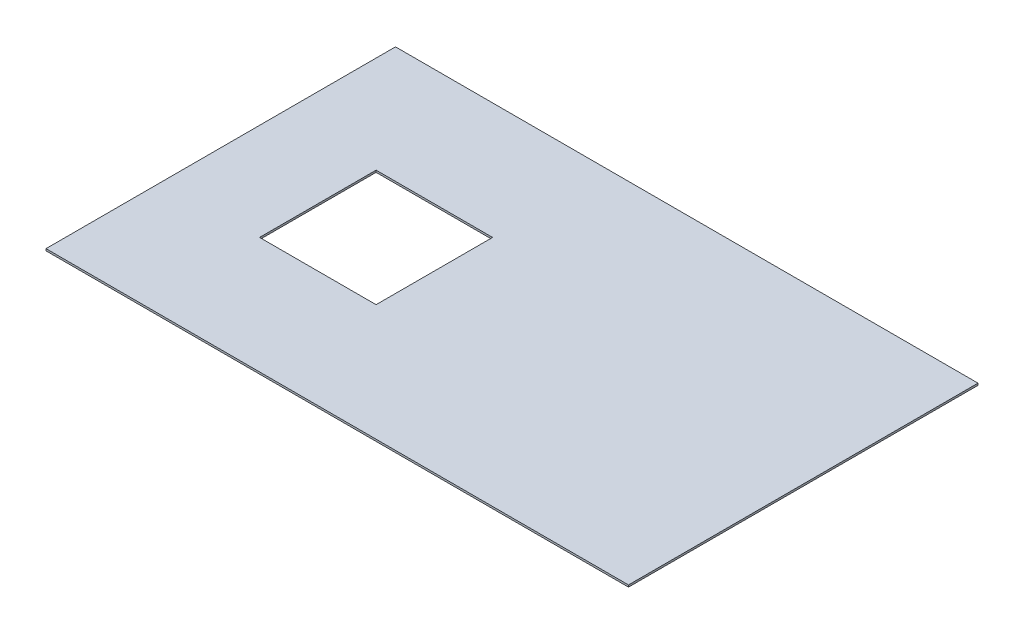
ISO-10303-21;
HEADER;
FILE_DESCRIPTION(('STEP AP214'),'2;1');
FILE_NAME('part.step','',(''),(''),'','','');
FILE_SCHEMA(('AUTOMOTIVE_DESIGN { 1 0 10303 214 1 1 1 1 }'));
ENDSEC;
DATA;
#1=APPLICATION_CONTEXT('core data for automotive mechanical design processes');
#2=APPLICATION_PROTOCOL_DEFINITION('international standard','automotive_design',2000,#1);
#3=PRODUCT_CONTEXT('',#1,'mechanical');
#4=PRODUCT('Part','Part','',(#3));
#5=PRODUCT_RELATED_PRODUCT_CATEGORY('part','',(#4));
#6=PRODUCT_DEFINITION_FORMATION('','',#4);
#7=PRODUCT_DEFINITION_CONTEXT('part definition',#1,'design');
#8=PRODUCT_DEFINITION('design','',#6,#7);
#9=PRODUCT_DEFINITION_SHAPE('','',#8);
#10=(LENGTH_UNIT() NAMED_UNIT(*) SI_UNIT(.MILLI.,.METRE.));
#11=(NAMED_UNIT(*) PLANE_ANGLE_UNIT() SI_UNIT($,.RADIAN.));
#12=(NAMED_UNIT(*) SI_UNIT($,.STERADIAN.) SOLID_ANGLE_UNIT());
#13=UNCERTAINTY_MEASURE_WITH_UNIT(LENGTH_MEASURE(1.E-05),#10,'distance_accuracy_value','');
#14=(GEOMETRIC_REPRESENTATION_CONTEXT(3) GLOBAL_UNCERTAINTY_ASSIGNED_CONTEXT((#13)) GLOBAL_UNIT_ASSIGNED_CONTEXT((#10,
#11,#12)) REPRESENTATION_CONTEXT('',''));
#15=CARTESIAN_POINT('',(0.,0.,0.));
#16=DIRECTION('',(0.,0.,1.));
#17=DIRECTION('',(1.,0.,0.));
#18=AXIS2_PLACEMENT_3D('',#15,#16,#17);
#19=CARTESIAN_POINT('',(0.,10.,0.));
#20=DIRECTION('',(-1.,0.,0.));
#21=DIRECTION('',(0.,0.,1.));
#22=AXIS2_PLACEMENT_3D('',#19,#20,#21);
#23=PLANE('',#22);
#24=DIRECTION('',(0.,0.,-1.));
#25=VECTOR('',#24,1.);
#26=CARTESIAN_POINT('',(0.,0.,0.));
#27=LINE('',#26,#25);
#28=CARTESIAN_POINT('',(0.,0.,0.));
#29=VERTEX_POINT('',#28);
#30=CARTESIAN_POINT('',(0.,0.,-1800.));
#31=VERTEX_POINT('',#30);
#32=EDGE_CURVE('E129',#29,#31,#27,.T.);
#33=ORIENTED_EDGE('',*,*,#32,.T.);
#34=DIRECTION('',(0.,-1.,0.));
#35=VECTOR('',#34,1.);
#36=CARTESIAN_POINT('',(0.,10.,-1800.));
#37=LINE('',#36,#35);
#38=CARTESIAN_POINT('',(0.,10.,-1800.));
#39=VERTEX_POINT('',#38);
#40=EDGE_CURVE('E11',#39,#31,#37,.T.);
#41=ORIENTED_EDGE('',*,*,#40,.F.);
#42=DIRECTION('',(0.,0.,-1.));
#43=VECTOR('',#42,1.);
#44=CARTESIAN_POINT('',(0.,10.,0.));
#45=LINE('',#44,#43);
#46=CARTESIAN_POINT('',(0.,10.,0.));
#47=VERTEX_POINT('',#46);
#48=EDGE_CURVE('E140',#47,#39,#45,.T.);
#49=ORIENTED_EDGE('',*,*,#48,.F.);
#50=DIRECTION('',(0.,-1.,0.));
#51=VECTOR('',#50,1.);
#52=CARTESIAN_POINT('',(0.,10.,0.));
#53=LINE('',#52,#51);
#54=EDGE_CURVE('E149',#47,#29,#53,.T.);
#55=ORIENTED_EDGE('',*,*,#54,.T.);
#56=EDGE_LOOP('',(#33,#41,#49,#55));
#57=FACE_BOUND('',#56,.T.);
#58=ADVANCED_FACE('F31',(#57),#23,.F.);
#59=CARTESIAN_POINT('',(0.,10.,-1800.));
#60=DIRECTION('',(0.,0.,1.));
#61=DIRECTION('',(1.,0.,0.));
#62=AXIS2_PLACEMENT_3D('',#59,#60,#61);
#63=PLANE('',#62);
#64=DIRECTION('',(-1.,0.,0.));
#65=VECTOR('',#64,1.);
#66=CARTESIAN_POINT('',(0.,0.,-1800.));
#67=LINE('',#66,#65);
#68=CARTESIAN_POINT('',(-3000.,0.,-1800.));
#69=VERTEX_POINT('',#68);
#70=EDGE_CURVE('E134',#31,#69,#67,.T.);
#71=ORIENTED_EDGE('',*,*,#70,.T.);
#72=DIRECTION('',(0.,-1.,0.));
#73=VECTOR('',#72,1.);
#74=CARTESIAN_POINT('',(-3000.,10.,-1800.));
#75=LINE('',#74,#73);
#76=CARTESIAN_POINT('',(-3000.,10.,-1800.));
#77=VERTEX_POINT('',#76);
#78=EDGE_CURVE('E38',#77,#69,#75,.T.);
#79=ORIENTED_EDGE('',*,*,#78,.F.);
#80=DIRECTION('',(-1.,0.,0.));
#81=VECTOR('',#80,1.);
#82=CARTESIAN_POINT('',(0.,10.,-1800.));
#83=LINE('',#82,#81);
#84=EDGE_CURVE('E143',#39,#77,#83,.T.);
#85=ORIENTED_EDGE('',*,*,#84,.F.);
#86=ORIENTED_EDGE('',*,*,#40,.T.);
#87=EDGE_LOOP('',(#71,#79,#85,#86));
#88=FACE_BOUND('',#87,.T.);
#89=ADVANCED_FACE('F173',(#88),#63,.F.);
#90=CARTESIAN_POINT('',(-3000.,10.,3.67381906146713E-13));
#91=DIRECTION('',(1.,0.,0.));
#92=DIRECTION('',(0.,0.,-1.));
#93=AXIS2_PLACEMENT_3D('',#90,#91,#92);
#94=PLANE('',#93);
#95=DIRECTION('',(0.,0.,1.));
#96=VECTOR('',#95,1.);
#97=CARTESIAN_POINT('',(-3000.,0.,3.67381906146713E-13));
#98=LINE('',#97,#96);
#99=CARTESIAN_POINT('',(-3000.,0.,3.67381906146713E-13));
#100=VERTEX_POINT('',#99);
#101=EDGE_CURVE('E136',#69,#100,#98,.T.);
#102=ORIENTED_EDGE('',*,*,#101,.T.);
#103=DIRECTION('',(0.,-1.,0.));
#104=VECTOR('',#103,1.);
#105=CARTESIAN_POINT('',(-3000.,10.,3.67381906146713E-13));
#106=LINE('',#105,#104);
#107=CARTESIAN_POINT('',(-3000.,10.,3.67381906146713E-13));
#108=VERTEX_POINT('',#107);
#109=EDGE_CURVE('E152',#108,#100,#106,.T.);
#110=ORIENTED_EDGE('',*,*,#109,.F.);
#111=DIRECTION('',(0.,0.,1.));
#112=VECTOR('',#111,1.);
#113=CARTESIAN_POINT('',(-3000.,10.,3.67381906146713E-13));
#114=LINE('',#113,#112);
#115=EDGE_CURVE('E145',#77,#108,#114,.T.);
#116=ORIENTED_EDGE('',*,*,#115,.F.);
#117=ORIENTED_EDGE('',*,*,#78,.T.);
#118=EDGE_LOOP('',(#102,#110,#116,#117));
#119=FACE_BOUND('',#118,.T.);
#120=ADVANCED_FACE('F159',(#119),#94,.F.);
#121=CARTESIAN_POINT('',(0.,10.,0.));
#122=DIRECTION('',(0.,0.,-1.));
#123=DIRECTION('',(-1.,0.,0.));
#124=AXIS2_PLACEMENT_3D('',#121,#122,#123);
#125=PLANE('',#124);
#126=DIRECTION('',(1.,0.,0.));
#127=VECTOR('',#126,1.);
#128=CARTESIAN_POINT('',(0.,0.,0.));
#129=LINE('',#128,#127);
#130=EDGE_CURVE('E138',#100,#29,#129,.T.);
#131=ORIENTED_EDGE('',*,*,#130,.T.);
#132=ORIENTED_EDGE('',*,*,#54,.F.);
#133=DIRECTION('',(1.,0.,0.));
#134=VECTOR('',#133,1.);
#135=CARTESIAN_POINT('',(0.,10.,0.));
#136=LINE('',#135,#134);
#137=EDGE_CURVE('E147',#108,#47,#136,.T.);
#138=ORIENTED_EDGE('',*,*,#137,.F.);
#139=ORIENTED_EDGE('',*,*,#109,.T.);
#140=EDGE_LOOP('',(#131,#132,#138,#139));
#141=FACE_BOUND('',#140,.T.);
#142=ADVANCED_FACE('F168',(#141),#125,.F.);
#143=CARTESIAN_POINT('',(0.,10.,0.));
#144=DIRECTION('',(0.,1.,0.));
#145=DIRECTION('',(0.,0.,1.));
#146=AXIS2_PLACEMENT_3D('',#143,#144,#145);
#147=PLANE('',#146);
#148=DIRECTION('',(0.,0.,-1.));
#149=VECTOR('',#148,1.);
#150=CARTESIAN_POINT('',(-1900.,10.,-600.));
#151=LINE('',#150,#149);
#152=CARTESIAN_POINT('',(-1900.,10.,-600.));
#153=VERTEX_POINT('',#152);
#154=CARTESIAN_POINT('',(-1900.,10.,-1200.));
#155=VERTEX_POINT('',#154);
#156=EDGE_CURVE('E45',#153,#155,#151,.T.);
#157=ORIENTED_EDGE('',*,*,#156,.F.);
#158=DIRECTION('',(1.,0.,0.));
#159=VECTOR('',#158,1.);
#160=CARTESIAN_POINT('',(-1900.,10.,-600.));
#161=LINE('',#160,#159);
#162=CARTESIAN_POINT('',(-2500.,10.,-600.));
#163=VERTEX_POINT('',#162);
#164=EDGE_CURVE('E113',#163,#153,#161,.T.);
#165=ORIENTED_EDGE('',*,*,#164,.F.);
#166=DIRECTION('',(0.,0.,1.));
#167=VECTOR('',#166,1.);
#168=CARTESIAN_POINT('',(-2500.,10.,-600.));
#169=LINE('',#168,#167);
#170=CARTESIAN_POINT('',(-2500.,10.,-1200.));
#171=VERTEX_POINT('',#170);
#172=EDGE_CURVE('E97',#171,#163,#169,.T.);
#173=ORIENTED_EDGE('',*,*,#172,.F.);
#174=DIRECTION('',(-1.,0.,0.));
#175=VECTOR('',#174,1.);
#176=CARTESIAN_POINT('',(-1900.,10.,-1200.));
#177=LINE('',#176,#175);
#178=EDGE_CURVE('E106',#155,#171,#177,.T.);
#179=ORIENTED_EDGE('',*,*,#178,.F.);
#180=EDGE_LOOP('',(#157,#165,#173,#179));
#181=FACE_BOUND('',#180,.T.);
#182=ORIENTED_EDGE('',*,*,#48,.T.);
#183=ORIENTED_EDGE('',*,*,#84,.T.);
#184=ORIENTED_EDGE('',*,*,#115,.T.);
#185=ORIENTED_EDGE('',*,*,#137,.T.);
#186=EDGE_LOOP('',(#182,#183,#184,#185));
#187=FACE_BOUND('',#186,.T.);
#188=ADVANCED_FACE('F110',(#181,#187),#147,.T.);
#189=CARTESIAN_POINT('',(0.,0.,0.));
#190=DIRECTION('',(0.,1.,0.));
#191=DIRECTION('',(0.,0.,1.));
#192=AXIS2_PLACEMENT_3D('',#189,#190,#191);
#193=PLANE('',#192);
#194=DIRECTION('',(1.,0.,0.));
#195=VECTOR('',#194,1.);
#196=CARTESIAN_POINT('',(-1900.,0.,-600.));
#197=LINE('',#196,#195);
#198=CARTESIAN_POINT('',(-2500.,0.,-600.));
#199=VERTEX_POINT('',#198);
#200=CARTESIAN_POINT('',(-1900.,0.,-600.));
#201=VERTEX_POINT('',#200);
#202=EDGE_CURVE('E124',#199,#201,#197,.T.);
#203=ORIENTED_EDGE('',*,*,#202,.T.);
#204=DIRECTION('',(0.,0.,-1.));
#205=VECTOR('',#204,1.);
#206=CARTESIAN_POINT('',(-1900.,0.,-600.));
#207=LINE('',#206,#205);
#208=CARTESIAN_POINT('',(-1900.,0.,-1200.));
#209=VERTEX_POINT('',#208);
#210=EDGE_CURVE('E115',#201,#209,#207,.T.);
#211=ORIENTED_EDGE('',*,*,#210,.T.);
#212=DIRECTION('',(-1.,0.,0.));
#213=VECTOR('',#212,1.);
#214=CARTESIAN_POINT('',(-1900.,0.,-1200.));
#215=LINE('',#214,#213);
#216=CARTESIAN_POINT('',(-2500.,0.,-1200.));
#217=VERTEX_POINT('',#216);
#218=EDGE_CURVE('E121',#209,#217,#215,.T.);
#219=ORIENTED_EDGE('',*,*,#218,.T.);
#220=DIRECTION('',(0.,0.,1.));
#221=VECTOR('',#220,1.);
#222=CARTESIAN_POINT('',(-2500.,0.,-600.));
#223=LINE('',#222,#221);
#224=EDGE_CURVE('E53',#217,#199,#223,.T.);
#225=ORIENTED_EDGE('',*,*,#224,.T.);
#226=EDGE_LOOP('',(#203,#211,#219,#225));
#227=FACE_BOUND('',#226,.T.);
#228=ORIENTED_EDGE('',*,*,#32,.F.);
#229=ORIENTED_EDGE('',*,*,#130,.F.);
#230=ORIENTED_EDGE('',*,*,#101,.F.);
#231=ORIENTED_EDGE('',*,*,#70,.F.);
#232=EDGE_LOOP('',(#228,#229,#230,#231));
#233=FACE_BOUND('',#232,.T.);
#234=ADVANCED_FACE('F165',(#227,#233),#193,.F.);
#235=CARTESIAN_POINT('',(-1900.,0.,-600.));
#236=DIRECTION('',(1.,0.,0.));
#237=DIRECTION('',(0.,0.,-1.));
#238=AXIS2_PLACEMENT_3D('',#235,#236,#237);
#239=PLANE('',#238);
#240=ORIENTED_EDGE('',*,*,#156,.T.);
#241=DIRECTION('',(0.,1.,0.));
#242=VECTOR('',#241,1.);
#243=CARTESIAN_POINT('',(-1900.,0.,-1200.));
#244=LINE('',#243,#242);
#245=EDGE_CURVE('E103',#209,#155,#244,.T.);
#246=ORIENTED_EDGE('',*,*,#245,.F.);
#247=ORIENTED_EDGE('',*,*,#210,.F.);
#248=DIRECTION('',(0.,1.,0.));
#249=VECTOR('',#248,1.);
#250=CARTESIAN_POINT('',(-1900.,0.,-600.));
#251=LINE('',#250,#249);
#252=EDGE_CURVE('E127',#201,#153,#251,.T.);
#253=ORIENTED_EDGE('',*,*,#252,.T.);
#254=EDGE_LOOP('',(#240,#246,#247,#253));
#255=FACE_BOUND('',#254,.T.);
#256=ADVANCED_FACE('F187',(#255),#239,.F.);
#257=CARTESIAN_POINT('',(-1900.,0.,-600.));
#258=DIRECTION('',(0.,0.,1.));
#259=DIRECTION('',(1.,0.,0.));
#260=AXIS2_PLACEMENT_3D('',#257,#258,#259);
#261=PLANE('',#260);
#262=ORIENTED_EDGE('',*,*,#164,.T.);
#263=ORIENTED_EDGE('',*,*,#252,.F.);
#264=ORIENTED_EDGE('',*,*,#202,.F.);
#265=DIRECTION('',(0.,1.,0.));
#266=VECTOR('',#265,1.);
#267=CARTESIAN_POINT('',(-2500.,0.,-600.));
#268=LINE('',#267,#266);
#269=EDGE_CURVE('E102',#199,#163,#268,.T.);
#270=ORIENTED_EDGE('',*,*,#269,.T.);
#271=EDGE_LOOP('',(#262,#263,#264,#270));
#272=FACE_BOUND('',#271,.T.);
#273=ADVANCED_FACE('F191',(#272),#261,.F.);
#274=CARTESIAN_POINT('',(-2500.,0.,-600.));
#275=DIRECTION('',(-1.,0.,0.));
#276=DIRECTION('',(0.,0.,1.));
#277=AXIS2_PLACEMENT_3D('',#274,#275,#276);
#278=PLANE('',#277);
#279=ORIENTED_EDGE('',*,*,#172,.T.);
#280=ORIENTED_EDGE('',*,*,#269,.F.);
#281=ORIENTED_EDGE('',*,*,#224,.F.);
#282=DIRECTION('',(0.,1.,0.));
#283=VECTOR('',#282,1.);
#284=CARTESIAN_POINT('',(-2500.,0.,-1200.));
#285=LINE('',#284,#283);
#286=EDGE_CURVE('E93',#217,#171,#285,.T.);
#287=ORIENTED_EDGE('',*,*,#286,.T.);
#288=EDGE_LOOP('',(#279,#280,#281,#287));
#289=FACE_BOUND('',#288,.T.);
#290=ADVANCED_FACE('F95',(#289),#278,.F.);
#291=CARTESIAN_POINT('',(-1900.,0.,-1200.));
#292=DIRECTION('',(0.,0.,-1.));
#293=DIRECTION('',(-1.,0.,0.));
#294=AXIS2_PLACEMENT_3D('',#291,#292,#293);
#295=PLANE('',#294);
#296=ORIENTED_EDGE('',*,*,#178,.T.);
#297=ORIENTED_EDGE('',*,*,#286,.F.);
#298=ORIENTED_EDGE('',*,*,#218,.F.);
#299=ORIENTED_EDGE('',*,*,#245,.T.);
#300=EDGE_LOOP('',(#296,#297,#298,#299));
#301=FACE_BOUND('',#300,.T.);
#302=ADVANCED_FACE('F107',(#301),#295,.F.);
#303=CLOSED_SHELL('',(#58,#89,#120,#142,#188,#234,#256,#273,#290,#302));
#304=MANIFOLD_SOLID_BREP('B2',#303);
#305=ADVANCED_BREP_SHAPE_REPRESENTATION('',(#18,#304),#14);
#306=SHAPE_DEFINITION_REPRESENTATION(#9,#305);
ENDSEC;
END-ISO-10303-21;
